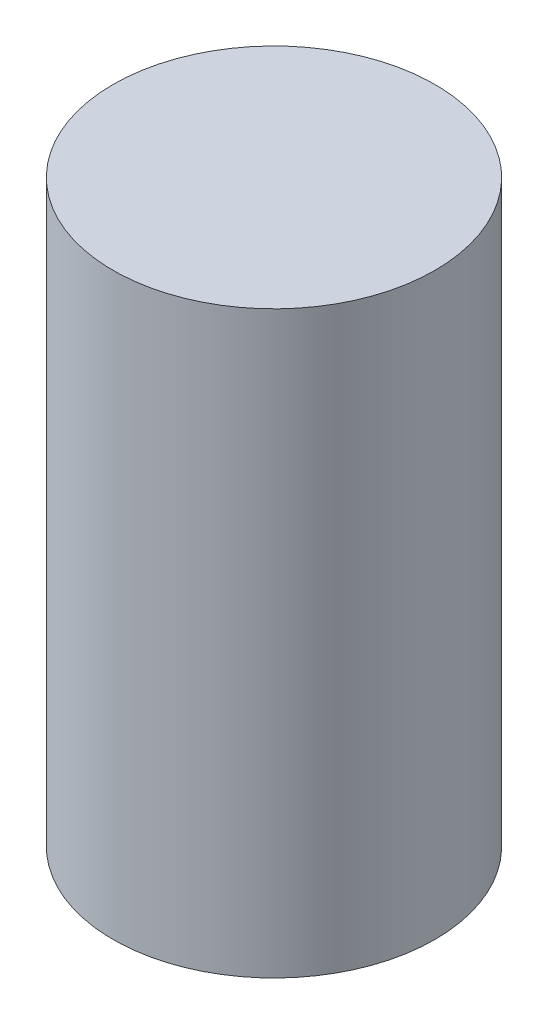
ISO-10303-21;
HEADER;
FILE_DESCRIPTION(('STEP AP214'),'2;1');
FILE_NAME('part.step','',(''),(''),'','','');
FILE_SCHEMA(('AUTOMOTIVE_DESIGN { 1 0 10303 214 1 1 1 1 }'));
ENDSEC;
DATA;
#1=APPLICATION_CONTEXT('core data for automotive mechanical design processes');
#2=APPLICATION_PROTOCOL_DEFINITION('international standard','automotive_design',2000,#1);
#3=PRODUCT_CONTEXT('',#1,'mechanical');
#4=PRODUCT('Part','Part','',(#3));
#5=PRODUCT_RELATED_PRODUCT_CATEGORY('part','',(#4));
#6=PRODUCT_DEFINITION_FORMATION('','',#4);
#7=PRODUCT_DEFINITION_CONTEXT('part definition',#1,'design');
#8=PRODUCT_DEFINITION('design','',#6,#7);
#9=PRODUCT_DEFINITION_SHAPE('','',#8);
#10=(LENGTH_UNIT() NAMED_UNIT(*) SI_UNIT(.MILLI.,.METRE.));
#11=(NAMED_UNIT(*) PLANE_ANGLE_UNIT() SI_UNIT($,.RADIAN.));
#12=(NAMED_UNIT(*) SI_UNIT($,.STERADIAN.) SOLID_ANGLE_UNIT());
#13=UNCERTAINTY_MEASURE_WITH_UNIT(LENGTH_MEASURE(1.E-05),#10,'distance_accuracy_value','');
#14=(GEOMETRIC_REPRESENTATION_CONTEXT(3) GLOBAL_UNCERTAINTY_ASSIGNED_CONTEXT((#13)) GLOBAL_UNIT_ASSIGNED_CONTEXT((#10,
#11,#12)) REPRESENTATION_CONTEXT('',''));
#15=CARTESIAN_POINT('',(0.,0.,0.));
#16=DIRECTION('',(0.,0.,1.));
#17=DIRECTION('',(1.,0.,0.));
#18=AXIS2_PLACEMENT_3D('',#15,#16,#17);
#19=CARTESIAN_POINT('',(0.,31.5,0.));
#20=DIRECTION('',(0.,-1.,0.));
#21=DIRECTION('',(1.,0.,0.));
#22=AXIS2_PLACEMENT_3D('',#19,#20,#21);
#23=CYLINDRICAL_SURFACE('',#22,17.5);
#24=CARTESIAN_POINT('',(0.,-31.5,0.));
#25=DIRECTION('',(0.,-1.,0.));
#26=DIRECTION('',(1.,0.,0.));
#27=AXIS2_PLACEMENT_3D('',#24,#25,#26);
#28=CIRCLE('',#27,17.5);
#29=CARTESIAN_POINT('',(17.4999999999999,-31.5,0.));
#30=VERTEX_POINT('',#29);
#31=EDGE_CURVE('E10',#30,#30,#28,.T.);
#32=ORIENTED_EDGE('',*,*,#31,.F.);
#33=EDGE_LOOP('',(#32));
#34=FACE_BOUND('',#33,.T.);
#35=CARTESIAN_POINT('',(0.,31.5,0.));
#36=DIRECTION('',(0.,-1.,0.));
#37=DIRECTION('',(1.,0.,0.));
#38=AXIS2_PLACEMENT_3D('',#35,#36,#37);
#39=CIRCLE('',#38,17.5);
#40=CARTESIAN_POINT('',(17.5,31.5,0.));
#41=VERTEX_POINT('',#40);
#42=EDGE_CURVE('E39',#41,#41,#39,.T.);
#43=ORIENTED_EDGE('',*,*,#42,.T.);
#44=EDGE_LOOP('',(#43));
#45=FACE_BOUND('',#44,.T.);
#46=ADVANCED_FACE('F33',(#34,#45),#23,.T.);
#47=CARTESIAN_POINT('',(-17.5,-31.5,0.));
#48=DIRECTION('',(0.,1.,0.));
#49=DIRECTION('',(-1.,0.,0.));
#50=AXIS2_PLACEMENT_3D('',#47,#48,#49);
#51=PLANE('',#50);
#52=ORIENTED_EDGE('',*,*,#31,.T.);
#53=EDGE_LOOP('',(#52));
#54=FACE_BOUND('',#53,.T.);
#55=ADVANCED_FACE('F48',(#54),#51,.F.);
#56=CARTESIAN_POINT('',(-17.5,31.5,0.));
#57=DIRECTION('',(0.,-1.,0.));
#58=DIRECTION('',(1.,0.,0.));
#59=AXIS2_PLACEMENT_3D('',#56,#57,#58);
#60=PLANE('',#59);
#61=ORIENTED_EDGE('',*,*,#42,.F.);
#62=EDGE_LOOP('',(#61));
#63=FACE_BOUND('',#62,.T.);
#64=ADVANCED_FACE('F46',(#63),#60,.F.);
#65=CLOSED_SHELL('',(#46,#55,#64));
#66=MANIFOLD_SOLID_BREP('B2',#65);
#67=ADVANCED_BREP_SHAPE_REPRESENTATION('',(#18,#66),#14);
#68=SHAPE_DEFINITION_REPRESENTATION(#9,#67);
ENDSEC;
END-ISO-10303-21;
